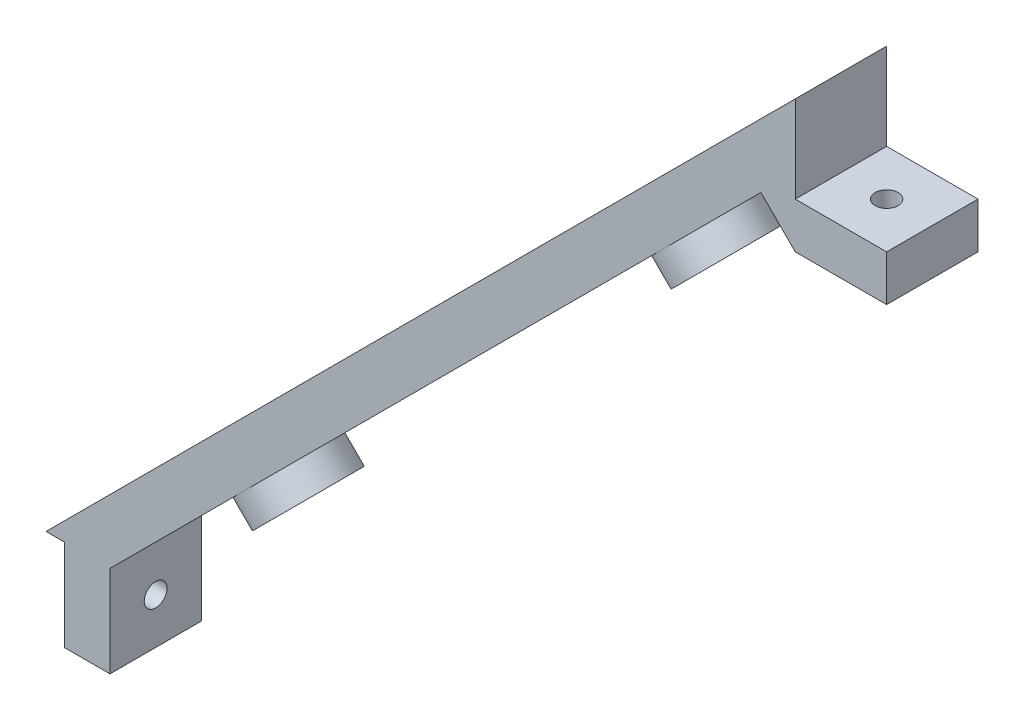
ISO-10303-21;
HEADER;
FILE_DESCRIPTION(('STEP AP214'),'2;1');
FILE_NAME('part.step','',(''),(''),'','','');
FILE_SCHEMA(('AUTOMOTIVE_DESIGN { 1 0 10303 214 1 1 1 1 }'));
ENDSEC;
DATA;
#1=APPLICATION_CONTEXT('core data for automotive mechanical design processes');
#2=APPLICATION_PROTOCOL_DEFINITION('international standard','automotive_design',2000,#1);
#3=PRODUCT_CONTEXT('',#1,'mechanical');
#4=PRODUCT('Part','Part','',(#3));
#5=PRODUCT_RELATED_PRODUCT_CATEGORY('part','',(#4));
#6=PRODUCT_DEFINITION_FORMATION('','',#4);
#7=PRODUCT_DEFINITION_CONTEXT('part definition',#1,'design');
#8=PRODUCT_DEFINITION('design','',#6,#7);
#9=PRODUCT_DEFINITION_SHAPE('','',#8);
#10=(LENGTH_UNIT() NAMED_UNIT(*) SI_UNIT(.MILLI.,.METRE.));
#11=(NAMED_UNIT(*) PLANE_ANGLE_UNIT() SI_UNIT($,.RADIAN.));
#12=(NAMED_UNIT(*) SI_UNIT($,.STERADIAN.) SOLID_ANGLE_UNIT());
#13=UNCERTAINTY_MEASURE_WITH_UNIT(LENGTH_MEASURE(1.E-05),#10,'distance_accuracy_value','');
#14=(GEOMETRIC_REPRESENTATION_CONTEXT(3) GLOBAL_UNCERTAINTY_ASSIGNED_CONTEXT((#13)) GLOBAL_UNIT_ASSIGNED_CONTEXT((#10,
#11,#12)) REPRESENTATION_CONTEXT('',''));
#15=CARTESIAN_POINT('',(0.,0.,0.));
#16=DIRECTION('',(0.,0.,1.));
#17=DIRECTION('',(1.,0.,0.));
#18=AXIS2_PLACEMENT_3D('',#15,#16,#17);
#19=CARTESIAN_POINT('',(-34.,-41.0000000000001,5.));
#20=DIRECTION('',(-0.707106781186549,0.707106781186546,0.));
#21=DIRECTION('',(-0.707106781186546,-0.707106781186549,0.));
#22=AXIS2_PLACEMENT_3D('',#19,#20,#21);
#23=PLANE('',#22);
#24=CARTESIAN_POINT('',(31.7842712474618,24.784271247462,0.));
#25=DIRECTION('',(-0.707106781186549,0.707106781186546,0.));
#26=DIRECTION('',(-0.707106781186546,-0.707106781186549,0.));
#27=AXIS2_PLACEMENT_3D('',#24,#25,#26);
#28=CIRCLE('',#27,1.25);
#29=CARTESIAN_POINT('',(30.9003877709787,23.9003877709788,0.));
#30=VERTEX_POINT('',#29);
#31=EDGE_CURVE('E212',#30,#30,#28,.T.);
#32=ORIENTED_EDGE('',*,*,#31,.T.);
#33=EDGE_LOOP('',(#32));
#34=FACE_BOUND('',#33,.T.);
#35=DIRECTION('',(0.707106781186546,0.707106781186549,0.));
#36=VECTOR('',#35,1.);
#37=CARTESIAN_POINT('',(-34.,-41.0000000000001,5.));
#38=LINE('',#37,#36);
#39=CARTESIAN_POINT('',(26.4102597104441,19.4102597104442,5.));
#40=VERTEX_POINT('',#39);
#41=CARTESIAN_POINT('',(37.25,30.2500000000001,5.));
#42=VERTEX_POINT('',#41);
#43=EDGE_CURVE('E142',#40,#42,#38,.T.);
#44=ORIENTED_EDGE('',*,*,#43,.F.);
#45=CARTESIAN_POINT('',(26.4102597104441,19.4102597104442,0.));
#46=DIRECTION('',(-0.707106781186549,0.707106781186546,0.));
#47=DIRECTION('',(-0.707106781186546,-0.707106781186549,0.));
#48=AXIS2_PLACEMENT_3D('',#45,#46,#47);
#49=CIRCLE('',#48,5.);
#50=CARTESIAN_POINT('',(26.4102597104441,19.4102597104442,-5.));
#51=VERTEX_POINT('',#50);
#52=EDGE_CURVE('E51',#40,#51,#49,.T.);
#53=ORIENTED_EDGE('',*,*,#52,.T.);
#54=DIRECTION('',(0.707106781186546,0.707106781186549,0.));
#55=VECTOR('',#54,1.);
#56=CARTESIAN_POINT('',(-34.,-41.0000000000001,-5.));
#57=LINE('',#56,#55);
#58=CARTESIAN_POINT('',(37.25,30.2500000000001,-5.));
#59=VERTEX_POINT('',#58);
#60=EDGE_CURVE('E140',#51,#59,#57,.T.);
#61=ORIENTED_EDGE('',*,*,#60,.T.);
#62=DIRECTION('',(0.,0.,-1.));
#63=VECTOR('',#62,1.);
#64=CARTESIAN_POINT('',(37.25,30.2500000000001,5.));
#65=LINE('',#64,#63);
#66=EDGE_CURVE('E193',#42,#59,#65,.T.);
#67=ORIENTED_EDGE('',*,*,#66,.F.);
#68=EDGE_LOOP('',(#44,#53,#61,#67));
#69=FACE_BOUND('',#68,.T.);
#70=ADVANCED_FACE('F35',(#34,#69),#23,.F.);
#71=CARTESIAN_POINT('',(-10.6421356237309,-17.6421356237309,0.));
#72=DIRECTION('',(-0.707106781186549,0.707106781186546,0.));
#73=DIRECTION('',(-0.707106781186546,-0.707106781186549,0.));
#74=AXIS2_PLACEMENT_3D('',#71,#72,#73);
#75=CIRCLE('',#74,1.25);
#76=CARTESIAN_POINT('',(-11.5260191002141,-18.5260191002141,0.));
#77=VERTEX_POINT('',#76);
#78=EDGE_CURVE('E334',#77,#77,#75,.T.);
#79=ORIENTED_EDGE('',*,*,#78,.T.);
#80=EDGE_LOOP('',(#79));
#81=FACE_BOUND('',#80,.T.);
#82=CARTESIAN_POINT('',(3.5,-3.49999999999998,0.));
#83=DIRECTION('',(-0.707106781186549,0.707106781186546,0.));
#84=DIRECTION('',(-0.707106781186546,-0.707106781186549,0.));
#85=AXIS2_PLACEMENT_3D('',#82,#83,#84);
#86=CIRCLE('',#85,1.25);
#87=CARTESIAN_POINT('',(2.61611652351681,-4.38388347648317,0.));
#88=VERTEX_POINT('',#87);
#89=EDGE_CURVE('E220',#88,#88,#86,.T.);
#90=ORIENTED_EDGE('',*,*,#89,.T.);
#91=EDGE_LOOP('',(#90));
#92=FACE_BOUND('',#91,.T.);
#93=CARTESIAN_POINT('',(17.6421356237309,10.642135623731,0.));
#94=DIRECTION('',(-0.707106781186549,0.707106781186546,0.));
#95=DIRECTION('',(-0.707106781186546,-0.707106781186549,0.));
#96=AXIS2_PLACEMENT_3D('',#93,#94,#95);
#97=CIRCLE('',#96,1.25);
#98=CARTESIAN_POINT('',(16.7582521472477,9.75825214724781,0.));
#99=VERTEX_POINT('',#98);
#100=EDGE_CURVE('E216',#99,#99,#97,.T.);
#101=ORIENTED_EDGE('',*,*,#100,.T.);
#102=EDGE_LOOP('',(#101));
#103=FACE_BOUND('',#102,.T.);
#104=CARTESIAN_POINT('',(-19.4102597104441,-26.4102597104442,-5.));
#105=VERTEX_POINT('',#104);
#106=EDGE_CURVE('E151',#105,#51,#57,.T.);
#107=ORIENTED_EDGE('',*,*,#106,.T.);
#108=EDGE_CURVE('E129',#51,#40,#49,.T.);
#109=ORIENTED_EDGE('',*,*,#108,.T.);
#110=CARTESIAN_POINT('',(-19.4102597104441,-26.4102597104442,5.));
#111=VERTEX_POINT('',#110);
#112=EDGE_CURVE('E273',#111,#40,#38,.T.);
#113=ORIENTED_EDGE('',*,*,#112,.F.);
#114=CARTESIAN_POINT('',(-19.4102597104441,-26.4102597104442,0.));
#115=DIRECTION('',(-0.707106781186549,0.707106781186546,0.));
#116=DIRECTION('',(-0.707106781186546,-0.707106781186549,0.));
#117=AXIS2_PLACEMENT_3D('',#114,#115,#116);
#118=CIRCLE('',#117,5.);
#119=EDGE_CURVE('E58',#111,#105,#118,.T.);
#120=ORIENTED_EDGE('',*,*,#119,.T.);
#121=EDGE_LOOP('',(#107,#109,#113,#120));
#122=FACE_BOUND('',#121,.T.);
#123=ADVANCED_FACE('F158',(#81,#92,#103,#122),#23,.F.);
#124=CARTESIAN_POINT('',(-41.,-41.0000000000001,5.));
#125=DIRECTION('',(0.,1.,0.));
#126=DIRECTION('',(0.,0.,1.));
#127=AXIS2_PLACEMENT_3D('',#124,#125,#126);
#128=PLANE('',#127);
#129=DIRECTION('',(1.,0.,0.));
#130=VECTOR('',#129,1.);
#131=CARTESIAN_POINT('',(-41.,-41.0000000000001,-5.));
#132=LINE('',#131,#130);
#133=CARTESIAN_POINT('',(-41.,-41.0000000000001,-5.));
#134=VERTEX_POINT('',#133);
#135=CARTESIAN_POINT('',(-39.,-41.0000000000001,-5.));
#136=VERTEX_POINT('',#135);
#137=EDGE_CURVE('E260',#134,#136,#132,.T.);
#138=ORIENTED_EDGE('',*,*,#137,.T.);
#139=DIRECTION('',(0.,0.,-1.));
#140=VECTOR('',#139,1.);
#141=CARTESIAN_POINT('',(-39.,-41.0000000000001,5.));
#142=LINE('',#141,#140);
#143=CARTESIAN_POINT('',(-39.,-41.0000000000001,5.));
#144=VERTEX_POINT('',#143);
#145=EDGE_CURVE('E11',#144,#136,#142,.T.);
#146=ORIENTED_EDGE('',*,*,#145,.F.);
#147=DIRECTION('',(1.,0.,0.));
#148=VECTOR('',#147,1.);
#149=CARTESIAN_POINT('',(-41.,-41.0000000000001,5.));
#150=LINE('',#149,#148);
#151=CARTESIAN_POINT('',(-41.,-41.0000000000001,5.));
#152=VERTEX_POINT('',#151);
#153=EDGE_CURVE('E173',#152,#144,#150,.T.);
#154=ORIENTED_EDGE('',*,*,#153,.F.);
#155=DIRECTION('',(0.,0.,-1.));
#156=VECTOR('',#155,1.);
#157=CARTESIAN_POINT('',(-41.,-41.0000000000001,5.));
#158=LINE('',#157,#156);
#159=EDGE_CURVE('E174',#152,#134,#158,.T.);
#160=ORIENTED_EDGE('',*,*,#159,.T.);
#161=EDGE_LOOP('',(#138,#146,#154,#160));
#162=FACE_BOUND('',#161,.T.);
#163=ADVANCED_FACE('F37',(#162),#128,.F.);
#164=CARTESIAN_POINT('',(-39.,-41.0000000000001,5.));
#165=DIRECTION('',(1.,0.,0.));
#166=DIRECTION('',(0.,0.,-1.));
#167=AXIS2_PLACEMENT_3D('',#164,#165,#166);
#168=PLANE('',#167);
#169=CARTESIAN_POINT('',(-39.,-46.0000000000003,0.));
#170=DIRECTION('',(1.,0.,0.));
#171=DIRECTION('',(0.,0.,-1.));
#172=AXIS2_PLACEMENT_3D('',#169,#170,#171);
#173=CIRCLE('',#172,1.25);
#174=CARTESIAN_POINT('',(-39.,-46.0000000000003,-1.25));
#175=VERTEX_POINT('',#174);
#176=EDGE_CURVE('E206',#175,#175,#173,.T.);
#177=ORIENTED_EDGE('',*,*,#176,.T.);
#178=EDGE_LOOP('',(#177));
#179=FACE_BOUND('',#178,.T.);
#180=DIRECTION('',(0.,-1.,0.));
#181=VECTOR('',#180,1.);
#182=CARTESIAN_POINT('',(-39.,-41.0000000000001,-5.));
#183=LINE('',#182,#181);
#184=CARTESIAN_POINT('',(-39.,-51.0000000000001,-5.));
#185=VERTEX_POINT('',#184);
#186=EDGE_CURVE('E286',#136,#185,#183,.T.);
#187=ORIENTED_EDGE('',*,*,#186,.T.);
#188=DIRECTION('',(0.,0.,-1.));
#189=VECTOR('',#188,1.);
#190=CARTESIAN_POINT('',(-39.,-51.0000000000001,5.));
#191=LINE('',#190,#189);
#192=CARTESIAN_POINT('',(-39.,-51.0000000000001,5.));
#193=VERTEX_POINT('',#192);
#194=EDGE_CURVE('E44',#193,#185,#191,.T.);
#195=ORIENTED_EDGE('',*,*,#194,.F.);
#196=DIRECTION('',(0.,-1.,0.));
#197=VECTOR('',#196,1.);
#198=CARTESIAN_POINT('',(-39.,-41.0000000000001,5.));
#199=LINE('',#198,#197);
#200=EDGE_CURVE('E263',#144,#193,#199,.T.);
#201=ORIENTED_EDGE('',*,*,#200,.F.);
#202=ORIENTED_EDGE('',*,*,#145,.T.);
#203=EDGE_LOOP('',(#187,#195,#201,#202));
#204=FACE_BOUND('',#203,.T.);
#205=ADVANCED_FACE('F305',(#179,#204),#168,.F.);
#206=CARTESIAN_POINT('',(-39.,-51.0000000000001,5.));
#207=DIRECTION('',(0.,1.,0.));
#208=DIRECTION('',(-1.,0.,0.));
#209=AXIS2_PLACEMENT_3D('',#206,#207,#208);
#210=PLANE('',#209);
#211=DIRECTION('',(1.,0.,0.));
#212=VECTOR('',#211,1.);
#213=CARTESIAN_POINT('',(-39.,-51.0000000000001,-5.));
#214=LINE('',#213,#212);
#215=CARTESIAN_POINT('',(-34.,-51.0000000000001,-5.));
#216=VERTEX_POINT('',#215);
#217=EDGE_CURVE('E287',#185,#216,#214,.T.);
#218=ORIENTED_EDGE('',*,*,#217,.T.);
#219=DIRECTION('',(0.,0.,-1.));
#220=VECTOR('',#219,1.);
#221=CARTESIAN_POINT('',(-34.,-51.0000000000001,5.));
#222=LINE('',#221,#220);
#223=CARTESIAN_POINT('',(-34.,-51.0000000000001,5.));
#224=VERTEX_POINT('',#223);
#225=EDGE_CURVE('E198',#224,#216,#222,.T.);
#226=ORIENTED_EDGE('',*,*,#225,.F.);
#227=DIRECTION('',(1.,0.,0.));
#228=VECTOR('',#227,1.);
#229=CARTESIAN_POINT('',(-39.,-51.0000000000001,5.));
#230=LINE('',#229,#228);
#231=EDGE_CURVE('E265',#193,#224,#230,.T.);
#232=ORIENTED_EDGE('',*,*,#231,.F.);
#233=ORIENTED_EDGE('',*,*,#194,.T.);
#234=EDGE_LOOP('',(#218,#226,#232,#233));
#235=FACE_BOUND('',#234,.T.);
#236=ADVANCED_FACE('F303',(#235),#210,.F.);
#237=CARTESIAN_POINT('',(-34.,-51.0000000000001,5.));
#238=DIRECTION('',(-1.,0.,0.));
#239=DIRECTION('',(0.,0.,1.));
#240=AXIS2_PLACEMENT_3D('',#237,#238,#239);
#241=PLANE('',#240);
#242=CARTESIAN_POINT('',(-34.,-46.0000000000003,0.));
#243=DIRECTION('',(-1.,0.,0.));
#244=DIRECTION('',(0.,0.,1.));
#245=AXIS2_PLACEMENT_3D('',#242,#243,#244);
#246=CIRCLE('',#245,1.25);
#247=CARTESIAN_POINT('',(-34.,-46.0000000000003,1.25));
#248=VERTEX_POINT('',#247);
#249=EDGE_CURVE('E203',#248,#248,#246,.T.);
#250=ORIENTED_EDGE('',*,*,#249,.T.);
#251=EDGE_LOOP('',(#250));
#252=FACE_BOUND('',#251,.T.);
#253=DIRECTION('',(0.,1.,0.));
#254=VECTOR('',#253,1.);
#255=CARTESIAN_POINT('',(-34.,-51.0000000000001,-5.));
#256=LINE('',#255,#254);
#257=CARTESIAN_POINT('',(-34.,-41.0000000000001,-5.));
#258=VERTEX_POINT('',#257);
#259=EDGE_CURVE('E155',#216,#258,#256,.T.);
#260=ORIENTED_EDGE('',*,*,#259,.T.);
#261=DIRECTION('',(0.,0.,-1.));
#262=VECTOR('',#261,1.);
#263=CARTESIAN_POINT('',(-34.,-41.0000000000001,5.));
#264=LINE('',#263,#262);
#265=CARTESIAN_POINT('',(-34.,-41.0000000000001,5.));
#266=VERTEX_POINT('',#265);
#267=EDGE_CURVE('E195',#266,#258,#264,.T.);
#268=ORIENTED_EDGE('',*,*,#267,.F.);
#269=DIRECTION('',(0.,1.,0.));
#270=VECTOR('',#269,1.);
#271=CARTESIAN_POINT('',(-34.,-51.0000000000001,5.));
#272=LINE('',#271,#270);
#273=EDGE_CURVE('E267',#224,#266,#272,.T.);
#274=ORIENTED_EDGE('',*,*,#273,.F.);
#275=ORIENTED_EDGE('',*,*,#225,.T.);
#276=EDGE_LOOP('',(#260,#268,#274,#275));
#277=FACE_BOUND('',#276,.T.);
#278=ADVANCED_FACE('F294',(#252,#277),#241,.F.);
#279=CARTESIAN_POINT('',(-24.7842712474619,-31.7842712474619,0.));
#280=DIRECTION('',(-0.707106781186549,0.707106781186546,0.));
#281=DIRECTION('',(-0.707106781186546,-0.707106781186549,0.));
#282=AXIS2_PLACEMENT_3D('',#279,#280,#281);
#283=CIRCLE('',#282,1.25);
#284=CARTESIAN_POINT('',(-25.668154723945,-32.6681547239451,0.));
#285=VERTEX_POINT('',#284);
#286=EDGE_CURVE('E332',#285,#285,#283,.T.);
#287=ORIENTED_EDGE('',*,*,#286,.T.);
#288=EDGE_LOOP('',(#287));
#289=FACE_BOUND('',#288,.T.);
#290=EDGE_CURVE('E157',#258,#105,#57,.T.);
#291=ORIENTED_EDGE('',*,*,#290,.T.);
#292=EDGE_CURVE('E247',#105,#111,#118,.T.);
#293=ORIENTED_EDGE('',*,*,#292,.T.);
#294=EDGE_CURVE('E269',#266,#111,#38,.T.);
#295=ORIENTED_EDGE('',*,*,#294,.F.);
#296=ORIENTED_EDGE('',*,*,#267,.T.);
#297=EDGE_LOOP('',(#291,#293,#295,#296));
#298=FACE_BOUND('',#297,.T.);
#299=ADVANCED_FACE('F298',(#289,#298),#23,.F.);
#300=CARTESIAN_POINT('',(41.,26.5000000000002,5.));
#301=DIRECTION('',(0.707106781186546,0.707106781186549,0.));
#302=DIRECTION('',(-0.707106781186549,0.707106781186546,0.));
#303=AXIS2_PLACEMENT_3D('',#300,#301,#302);
#304=PLANE('',#303);
#305=DIRECTION('',(0.707106781186549,-0.707106781186546,0.));
#306=VECTOR('',#305,1.);
#307=CARTESIAN_POINT('',(41.,26.5000000000002,-5.));
#308=LINE('',#307,#306);
#309=CARTESIAN_POINT('',(41.,26.5000000000002,-5.));
#310=VERTEX_POINT('',#309);
#311=EDGE_CURVE('E154',#59,#310,#308,.T.);
#312=ORIENTED_EDGE('',*,*,#311,.T.);
#313=DIRECTION('',(0.,0.,-1.));
#314=VECTOR('',#313,1.);
#315=CARTESIAN_POINT('',(41.,26.5000000000002,5.));
#316=LINE('',#315,#314);
#317=CARTESIAN_POINT('',(41.,26.5000000000002,5.));
#318=VERTEX_POINT('',#317);
#319=EDGE_CURVE('E190',#318,#310,#316,.T.);
#320=ORIENTED_EDGE('',*,*,#319,.F.);
#321=DIRECTION('',(0.707106781186549,-0.707106781186546,0.));
#322=VECTOR('',#321,1.);
#323=CARTESIAN_POINT('',(41.,26.5000000000002,5.));
#324=LINE('',#323,#322);
#325=EDGE_CURVE('E272',#42,#318,#324,.T.);
#326=ORIENTED_EDGE('',*,*,#325,.F.);
#327=ORIENTED_EDGE('',*,*,#66,.T.);
#328=EDGE_LOOP('',(#312,#320,#326,#327));
#329=FACE_BOUND('',#328,.T.);
#330=ADVANCED_FACE('F323',(#329),#304,.F.);
#331=CARTESIAN_POINT('',(41.,26.5000000000002,5.));
#332=DIRECTION('',(0.,1.,0.));
#333=DIRECTION('',(0.,0.,1.));
#334=AXIS2_PLACEMENT_3D('',#331,#332,#333);
#335=PLANE('',#334);
#336=CARTESIAN_POINT('',(46.,26.5000000000002,0.));
#337=DIRECTION('',(0.,1.,0.));
#338=DIRECTION('',(0.,0.,1.));
#339=AXIS2_PLACEMENT_3D('',#336,#337,#338);
#340=CIRCLE('',#339,1.25);
#341=CARTESIAN_POINT('',(46.,26.5000000000002,1.25));
#342=VERTEX_POINT('',#341);
#343=EDGE_CURVE('E207',#342,#342,#340,.F.);
#344=ORIENTED_EDGE('',*,*,#343,.F.);
#345=EDGE_LOOP('',(#344));
#346=FACE_BOUND('',#345,.T.);
#347=DIRECTION('',(1.,0.,0.));
#348=VECTOR('',#347,1.);
#349=CARTESIAN_POINT('',(41.,26.5000000000002,-5.));
#350=LINE('',#349,#348);
#351=CARTESIAN_POINT('',(51.,26.5000000000002,-5.));
#352=VERTEX_POINT('',#351);
#353=EDGE_CURVE('E163',#310,#352,#350,.T.);
#354=ORIENTED_EDGE('',*,*,#353,.T.);
#355=DIRECTION('',(0.,0.,-1.));
#356=VECTOR('',#355,1.);
#357=CARTESIAN_POINT('',(51.,26.5000000000002,5.));
#358=LINE('',#357,#356);
#359=CARTESIAN_POINT('',(51.,26.5000000000002,5.));
#360=VERTEX_POINT('',#359);
#361=EDGE_CURVE('E187',#360,#352,#358,.T.);
#362=ORIENTED_EDGE('',*,*,#361,.F.);
#363=DIRECTION('',(1.,0.,0.));
#364=VECTOR('',#363,1.);
#365=CARTESIAN_POINT('',(41.,26.5000000000002,5.));
#366=LINE('',#365,#364);
#367=EDGE_CURVE('E275',#318,#360,#366,.T.);
#368=ORIENTED_EDGE('',*,*,#367,.F.);
#369=ORIENTED_EDGE('',*,*,#319,.T.);
#370=EDGE_LOOP('',(#354,#362,#368,#369));
#371=FACE_BOUND('',#370,.T.);
#372=ADVANCED_FACE('F328',(#346,#371),#335,.F.);
#373=CARTESIAN_POINT('',(51.,31.5000000000002,5.));
#374=DIRECTION('',(-1.,0.,0.));
#375=DIRECTION('',(0.,-1.,0.));
#376=AXIS2_PLACEMENT_3D('',#373,#374,#375);
#377=PLANE('',#376);
#378=DIRECTION('',(0.,1.,0.));
#379=VECTOR('',#378,1.);
#380=CARTESIAN_POINT('',(51.,31.5000000000002,-5.));
#381=LINE('',#380,#379);
#382=CARTESIAN_POINT('',(51.,31.5000000000002,-5.));
#383=VERTEX_POINT('',#382);
#384=EDGE_CURVE('E165',#352,#383,#381,.T.);
#385=ORIENTED_EDGE('',*,*,#384,.T.);
#386=DIRECTION('',(0.,0.,-1.));
#387=VECTOR('',#386,1.);
#388=CARTESIAN_POINT('',(51.,31.5000000000002,5.));
#389=LINE('',#388,#387);
#390=CARTESIAN_POINT('',(51.,31.5000000000002,5.));
#391=VERTEX_POINT('',#390);
#392=EDGE_CURVE('E184',#391,#383,#389,.T.);
#393=ORIENTED_EDGE('',*,*,#392,.F.);
#394=DIRECTION('',(0.,1.,0.));
#395=VECTOR('',#394,1.);
#396=CARTESIAN_POINT('',(51.,31.5000000000002,5.));
#397=LINE('',#396,#395);
#398=EDGE_CURVE('E277',#360,#391,#397,.T.);
#399=ORIENTED_EDGE('',*,*,#398,.F.);
#400=ORIENTED_EDGE('',*,*,#361,.T.);
#401=EDGE_LOOP('',(#385,#393,#399,#400));
#402=FACE_BOUND('',#401,.T.);
#403=ADVANCED_FACE('F384',(#402),#377,.F.);
#404=CARTESIAN_POINT('',(51.,31.5000000000002,5.));
#405=DIRECTION('',(0.,-1.,0.));
#406=DIRECTION('',(0.,0.,-1.));
#407=AXIS2_PLACEMENT_3D('',#404,#405,#406);
#408=PLANE('',#407);
#409=CARTESIAN_POINT('',(46.,31.5000000000002,0.));
#410=DIRECTION('',(0.,-1.,0.));
#411=DIRECTION('',(0.,0.,-1.));
#412=AXIS2_PLACEMENT_3D('',#409,#410,#411);
#413=CIRCLE('',#412,1.25);
#414=CARTESIAN_POINT('',(46.,31.5000000000002,-1.24999999999999));
#415=VERTEX_POINT('',#414);
#416=EDGE_CURVE('E252',#415,#415,#413,.T.);
#417=ORIENTED_EDGE('',*,*,#416,.T.);
#418=EDGE_LOOP('',(#417));
#419=FACE_BOUND('',#418,.T.);
#420=DIRECTION('',(-1.,0.,0.));
#421=VECTOR('',#420,1.);
#422=CARTESIAN_POINT('',(51.,31.5000000000002,-5.));
#423=LINE('',#422,#421);
#424=CARTESIAN_POINT('',(41.,31.5000000000002,-5.));
#425=VERTEX_POINT('',#424);
#426=EDGE_CURVE('E167',#383,#425,#423,.T.);
#427=ORIENTED_EDGE('',*,*,#426,.T.);
#428=DIRECTION('',(0.,0.,-1.));
#429=VECTOR('',#428,1.);
#430=CARTESIAN_POINT('',(41.,31.5000000000002,5.));
#431=LINE('',#430,#429);
#432=CARTESIAN_POINT('',(41.,31.5000000000002,5.));
#433=VERTEX_POINT('',#432);
#434=EDGE_CURVE('E181',#433,#425,#431,.T.);
#435=ORIENTED_EDGE('',*,*,#434,.F.);
#436=DIRECTION('',(-1.,0.,0.));
#437=VECTOR('',#436,1.);
#438=CARTESIAN_POINT('',(51.,31.5000000000002,5.));
#439=LINE('',#438,#437);
#440=EDGE_CURVE('E279',#391,#433,#439,.T.);
#441=ORIENTED_EDGE('',*,*,#440,.F.);
#442=ORIENTED_EDGE('',*,*,#392,.T.);
#443=EDGE_LOOP('',(#427,#435,#441,#442));
#444=FACE_BOUND('',#443,.T.);
#445=ADVANCED_FACE('F380',(#419,#444),#408,.F.);
#446=CARTESIAN_POINT('',(41.,41.0000000000002,5.));
#447=DIRECTION('',(-1.,0.,0.));
#448=DIRECTION('',(0.,-1.,0.));
#449=AXIS2_PLACEMENT_3D('',#446,#447,#448);
#450=PLANE('',#449);
#451=DIRECTION('',(0.,1.,0.));
#452=VECTOR('',#451,1.);
#453=CARTESIAN_POINT('',(41.,41.0000000000002,-5.));
#454=LINE('',#453,#452);
#455=CARTESIAN_POINT('',(41.,41.0000000000002,-5.));
#456=VERTEX_POINT('',#455);
#457=EDGE_CURVE('E169',#425,#456,#454,.T.);
#458=ORIENTED_EDGE('',*,*,#457,.T.);
#459=DIRECTION('',(0.,0.,-1.));
#460=VECTOR('',#459,1.);
#461=CARTESIAN_POINT('',(41.,41.0000000000002,5.));
#462=LINE('',#461,#460);
#463=CARTESIAN_POINT('',(41.,41.0000000000002,5.));
#464=VERTEX_POINT('',#463);
#465=EDGE_CURVE('E177',#464,#456,#462,.T.);
#466=ORIENTED_EDGE('',*,*,#465,.F.);
#467=DIRECTION('',(0.,1.,0.));
#468=VECTOR('',#467,1.);
#469=CARTESIAN_POINT('',(41.,41.0000000000002,5.));
#470=LINE('',#469,#468);
#471=EDGE_CURVE('E281',#433,#464,#470,.T.);
#472=ORIENTED_EDGE('',*,*,#471,.F.);
#473=ORIENTED_EDGE('',*,*,#434,.T.);
#474=EDGE_LOOP('',(#458,#466,#472,#473));
#475=FACE_BOUND('',#474,.T.);
#476=ADVANCED_FACE('F353',(#475),#450,.F.);
#477=CARTESIAN_POINT('',(-41.,-41.0000000000001,5.));
#478=DIRECTION('',(0.707106781186549,-0.707106781186546,0.));
#479=DIRECTION('',(0.707106781186546,0.707106781186549,0.));
#480=AXIS2_PLACEMENT_3D('',#477,#478,#479);
#481=PLANE('',#480);
#482=CARTESIAN_POINT('',(-14.1421356237309,-14.142135623731,0.));
#483=DIRECTION('',(0.707106781186549,-0.707106781186546,0.));
#484=DIRECTION('',(0.707106781186546,0.707106781186549,0.));
#485=AXIS2_PLACEMENT_3D('',#482,#483,#484);
#486=CIRCLE('',#485,1.25);
#487=CARTESIAN_POINT('',(-13.2582521472477,-13.2582521472478,0.));
#488=VERTEX_POINT('',#487);
#489=EDGE_CURVE('E39',#488,#488,#486,.F.);
#490=ORIENTED_EDGE('',*,*,#489,.F.);
#491=EDGE_LOOP('',(#490));
#492=FACE_BOUND('',#491,.T.);
#493=CARTESIAN_POINT('',(-28.2842712474619,-28.2842712474619,0.));
#494=DIRECTION('',(0.707106781186549,-0.707106781186546,0.));
#495=DIRECTION('',(0.707106781186546,0.707106781186549,0.));
#496=AXIS2_PLACEMENT_3D('',#493,#494,#495);
#497=CIRCLE('',#496,1.25);
#498=CARTESIAN_POINT('',(-27.4003877709787,-27.4003877709788,0.));
#499=VERTEX_POINT('',#498);
#500=EDGE_CURVE('E219',#499,#499,#497,.F.);
#501=ORIENTED_EDGE('',*,*,#500,.F.);
#502=EDGE_LOOP('',(#501));
#503=FACE_BOUND('',#502,.T.);
#504=CARTESIAN_POINT('',(0.,0.,0.));
#505=DIRECTION('',(0.707106781186549,-0.707106781186546,0.));
#506=DIRECTION('',(0.707106781186546,0.707106781186549,0.));
#507=AXIS2_PLACEMENT_3D('',#504,#505,#506);
#508=CIRCLE('',#507,1.25);
#509=CARTESIAN_POINT('',(0.88388347648317,0.883883476483208,0.));
#510=VERTEX_POINT('',#509);
#511=EDGE_CURVE('E217',#510,#510,#508,.F.);
#512=ORIENTED_EDGE('',*,*,#511,.F.);
#513=EDGE_LOOP('',(#512));
#514=FACE_BOUND('',#513,.T.);
#515=CARTESIAN_POINT('',(14.1421356237309,14.142135623731,0.));
#516=DIRECTION('',(0.707106781186549,-0.707106781186546,0.));
#517=DIRECTION('',(0.707106781186546,0.707106781186549,0.));
#518=AXIS2_PLACEMENT_3D('',#515,#516,#517);
#519=CIRCLE('',#518,1.25);
#520=CARTESIAN_POINT('',(15.0260191002141,15.0260191002142,0.));
#521=VERTEX_POINT('',#520);
#522=EDGE_CURVE('E213',#521,#521,#519,.F.);
#523=ORIENTED_EDGE('',*,*,#522,.F.);
#524=EDGE_LOOP('',(#523));
#525=FACE_BOUND('',#524,.T.);
#526=CARTESIAN_POINT('',(28.2842712474618,28.284271247462,0.));
#527=DIRECTION('',(0.707106781186549,-0.707106781186546,0.));
#528=DIRECTION('',(0.707106781186546,0.707106781186549,0.));
#529=AXIS2_PLACEMENT_3D('',#526,#527,#528);
#530=CIRCLE('',#529,1.25);
#531=CARTESIAN_POINT('',(29.168154723945,29.1681547239452,0.));
#532=VERTEX_POINT('',#531);
#533=EDGE_CURVE('E208',#532,#532,#530,.F.);
#534=ORIENTED_EDGE('',*,*,#533,.F.);
#535=EDGE_LOOP('',(#534));
#536=FACE_BOUND('',#535,.T.);
#537=CARTESIAN_POINT('',(-22.9102597104441,-22.9102597104442,0.));
#538=DIRECTION('',(0.707106781186549,-0.707106781186546,0.));
#539=DIRECTION('',(0.707106781186546,0.707106781186549,0.));
#540=AXIS2_PLACEMENT_3D('',#537,#538,#539);
#541=CIRCLE('',#540,1.25);
#542=CARTESIAN_POINT('',(-22.0263762339609,-22.026376233961,0.));
#543=VERTEX_POINT('',#542);
#544=EDGE_CURVE('E238',#543,#543,#541,.T.);
#545=ORIENTED_EDGE('',*,*,#544,.T.);
#546=EDGE_LOOP('',(#545));
#547=FACE_BOUND('',#546,.T.);
#548=CARTESIAN_POINT('',(22.9102597104441,22.9102597104442,0.));
#549=DIRECTION('',(0.707106781186549,-0.707106781186546,0.));
#550=DIRECTION('',(0.707106781186546,0.707106781186549,0.));
#551=AXIS2_PLACEMENT_3D('',#548,#549,#550);
#552=CIRCLE('',#551,1.25);
#553=CARTESIAN_POINT('',(23.7941431869273,23.7941431869274,0.));
#554=VERTEX_POINT('',#553);
#555=EDGE_CURVE('E135',#554,#554,#552,.T.);
#556=ORIENTED_EDGE('',*,*,#555,.T.);
#557=EDGE_LOOP('',(#556));
#558=FACE_BOUND('',#557,.T.);
#559=DIRECTION('',(-0.707106781186546,-0.707106781186549,0.));
#560=VECTOR('',#559,1.);
#561=CARTESIAN_POINT('',(-41.,-41.0000000000001,-5.));
#562=LINE('',#561,#560);
#563=EDGE_CURVE('E171',#456,#134,#562,.T.);
#564=ORIENTED_EDGE('',*,*,#563,.T.);
#565=ORIENTED_EDGE('',*,*,#159,.F.);
#566=DIRECTION('',(-0.707106781186546,-0.707106781186549,0.));
#567=VECTOR('',#566,1.);
#568=CARTESIAN_POINT('',(-41.,-41.0000000000001,5.));
#569=LINE('',#568,#567);
#570=EDGE_CURVE('E178',#464,#152,#569,.T.);
#571=ORIENTED_EDGE('',*,*,#570,.F.);
#572=ORIENTED_EDGE('',*,*,#465,.T.);
#573=EDGE_LOOP('',(#564,#565,#571,#572));
#574=FACE_BOUND('',#573,.T.);
#575=ADVANCED_FACE('F350',(#492,#503,#514,#525,#536,#547,#558,#574),#481,.F.);
#576=CARTESIAN_POINT('',(0.,0.,5.));
#577=DIRECTION('',(0.,0.,-1.));
#578=DIRECTION('',(-1.,0.,0.));
#579=AXIS2_PLACEMENT_3D('',#576,#577,#578);
#580=PLANE('',#579);
#581=ORIENTED_EDGE('',*,*,#153,.T.);
#582=ORIENTED_EDGE('',*,*,#200,.T.);
#583=ORIENTED_EDGE('',*,*,#231,.T.);
#584=ORIENTED_EDGE('',*,*,#273,.T.);
#585=ORIENTED_EDGE('',*,*,#294,.T.);
#586=ORIENTED_EDGE('',*,*,#112,.T.);
#587=ORIENTED_EDGE('',*,*,#43,.T.);
#588=ORIENTED_EDGE('',*,*,#325,.T.);
#589=ORIENTED_EDGE('',*,*,#367,.T.);
#590=ORIENTED_EDGE('',*,*,#398,.T.);
#591=ORIENTED_EDGE('',*,*,#440,.T.);
#592=ORIENTED_EDGE('',*,*,#471,.T.);
#593=ORIENTED_EDGE('',*,*,#570,.T.);
#594=EDGE_LOOP('',(#581,#582,#583,#584,#585,#586,#587,#588,#589,#590,#591,#592,#593));
#595=FACE_BOUND('',#594,.T.);
#596=ADVANCED_FACE('F300',(#595),#580,.F.);
#597=CARTESIAN_POINT('',(0.,0.,-5.));
#598=DIRECTION('',(0.,0.,-1.));
#599=DIRECTION('',(-1.,0.,0.));
#600=AXIS2_PLACEMENT_3D('',#597,#598,#599);
#601=PLANE('',#600);
#602=ORIENTED_EDGE('',*,*,#137,.F.);
#603=ORIENTED_EDGE('',*,*,#563,.F.);
#604=ORIENTED_EDGE('',*,*,#457,.F.);
#605=ORIENTED_EDGE('',*,*,#426,.F.);
#606=ORIENTED_EDGE('',*,*,#384,.F.);
#607=ORIENTED_EDGE('',*,*,#353,.F.);
#608=ORIENTED_EDGE('',*,*,#311,.F.);
#609=ORIENTED_EDGE('',*,*,#60,.F.);
#610=ORIENTED_EDGE('',*,*,#106,.F.);
#611=ORIENTED_EDGE('',*,*,#290,.F.);
#612=ORIENTED_EDGE('',*,*,#259,.F.);
#613=ORIENTED_EDGE('',*,*,#217,.F.);
#614=ORIENTED_EDGE('',*,*,#186,.F.);
#615=EDGE_LOOP('',(#602,#603,#604,#605,#606,#607,#608,#609,#610,#611,#612,#613,#614));
#616=FACE_BOUND('',#615,.T.);
#617=ADVANCED_FACE('F149',(#616),#601,.T.);
#618=CARTESIAN_POINT('',(-41.,-46.0000000000003,0.));
#619=DIRECTION('',(1.,0.,0.));
#620=DIRECTION('',(0.,1.,0.));
#621=AXIS2_PLACEMENT_3D('',#618,#619,#620);
#622=CYLINDRICAL_SURFACE('',#621,1.25);
#623=ORIENTED_EDGE('',*,*,#249,.F.);
#624=EDGE_LOOP('',(#623));
#625=FACE_BOUND('',#624,.T.);
#626=ORIENTED_EDGE('',*,*,#176,.F.);
#627=EDGE_LOOP('',(#626));
#628=FACE_BOUND('',#627,.T.);
#629=ADVANCED_FACE('F406',(#625,#628),#622,.F.);
#630=CARTESIAN_POINT('',(46.,-51.0000000000001,0.));
#631=DIRECTION('',(0.,1.,0.));
#632=DIRECTION('',(0.,0.,1.));
#633=AXIS2_PLACEMENT_3D('',#630,#631,#632);
#634=CYLINDRICAL_SURFACE('',#633,1.25);
#635=ORIENTED_EDGE('',*,*,#416,.F.);
#636=EDGE_LOOP('',(#635));
#637=FACE_BOUND('',#636,.T.);
#638=ORIENTED_EDGE('',*,*,#343,.T.);
#639=EDGE_LOOP('',(#638));
#640=FACE_BOUND('',#639,.T.);
#641=ADVANCED_FACE('F411',(#637,#640),#634,.F.);
#642=CARTESIAN_POINT('',(-17.2889393668845,-28.5315800540038,0.));
#643=DIRECTION('',(-0.707106781186549,0.707106781186546,0.));
#644=DIRECTION('',(-0.707106781186546,-0.707106781186549,0.));
#645=AXIS2_PLACEMENT_3D('',#642,#643,#644);
#646=CYLINDRICAL_SURFACE('',#645,5.);
#647=CARTESIAN_POINT('',(-17.2889393668845,-28.5315800540038,0.));
#648=DIRECTION('',(-0.707106781186549,0.707106781186546,0.));
#649=DIRECTION('',(-0.707106781186546,-0.707106781186549,0.));
#650=AXIS2_PLACEMENT_3D('',#647,#648,#649);
#651=CIRCLE('',#650,5.);
#652=CARTESIAN_POINT('',(-20.8244732728172,-32.0671139599365,0.));
#653=VERTEX_POINT('',#652);
#654=EDGE_CURVE('E249',#653,#653,#651,.T.);
#655=ORIENTED_EDGE('',*,*,#654,.T.);
#656=EDGE_LOOP('',(#655));
#657=FACE_BOUND('',#656,.T.);
#658=ORIENTED_EDGE('',*,*,#119,.F.);
#659=ORIENTED_EDGE('',*,*,#292,.F.);
#660=EDGE_LOOP('',(#658,#659));
#661=FACE_BOUND('',#660,.T.);
#662=ADVANCED_FACE('F415',(#657,#661),#646,.T.);
#663=CARTESIAN_POINT('',(-17.2889393668845,-28.5315800540038,0.));
#664=DIRECTION('',(-0.707106781186549,0.707106781186546,0.));
#665=DIRECTION('',(-0.707106781186546,-0.707106781186549,0.));
#666=AXIS2_PLACEMENT_3D('',#663,#664,#665);
#667=PLANE('',#666);
#668=CARTESIAN_POINT('',(-17.2889393668845,-28.5315800540038,0.));
#669=DIRECTION('',(0.707106781186549,-0.707106781186546,0.));
#670=DIRECTION('',(0.707106781186546,0.707106781186549,0.));
#671=AXIS2_PLACEMENT_3D('',#668,#669,#670);
#672=CIRCLE('',#671,1.25);
#673=CARTESIAN_POINT('',(-16.4050558904013,-27.6476965775206,0.));
#674=VERTEX_POINT('',#673);
#675=EDGE_CURVE('E211',#674,#674,#672,.T.);
#676=ORIENTED_EDGE('',*,*,#675,.F.);
#677=EDGE_LOOP('',(#676));
#678=FACE_BOUND('',#677,.T.);
#679=ORIENTED_EDGE('',*,*,#654,.F.);
#680=EDGE_LOOP('',(#679));
#681=FACE_BOUND('',#680,.T.);
#682=ADVANCED_FACE('F419',(#678,#681),#667,.F.);
#683=CARTESIAN_POINT('',(28.5315800540037,17.2889393668846,0.));
#684=DIRECTION('',(-0.707106781186549,0.707106781186546,0.));
#685=DIRECTION('',(-0.707106781186546,-0.707106781186549,0.));
#686=AXIS2_PLACEMENT_3D('',#683,#684,#685);
#687=CYLINDRICAL_SURFACE('',#686,5.);
#688=CARTESIAN_POINT('',(28.5315800540037,17.2889393668846,0.));
#689=DIRECTION('',(-0.707106781186549,0.707106781186546,0.));
#690=DIRECTION('',(-0.707106781186546,-0.707106781186549,0.));
#691=AXIS2_PLACEMENT_3D('',#688,#689,#690);
#692=CIRCLE('',#691,5.);
#693=CARTESIAN_POINT('',(24.996046148071,13.7534054609518,0.));
#694=VERTEX_POINT('',#693);
#695=EDGE_CURVE('E144',#694,#694,#692,.T.);
#696=ORIENTED_EDGE('',*,*,#695,.T.);
#697=EDGE_LOOP('',(#696));
#698=FACE_BOUND('',#697,.T.);
#699=ORIENTED_EDGE('',*,*,#52,.F.);
#700=ORIENTED_EDGE('',*,*,#108,.F.);
#701=EDGE_LOOP('',(#699,#700));
#702=FACE_BOUND('',#701,.T.);
#703=ADVANCED_FACE('F130',(#698,#702),#687,.T.);
#704=CARTESIAN_POINT('',(28.5315800540037,17.2889393668846,0.));
#705=DIRECTION('',(-0.707106781186549,0.707106781186546,0.));
#706=DIRECTION('',(-0.707106781186546,-0.707106781186549,0.));
#707=AXIS2_PLACEMENT_3D('',#704,#705,#706);
#708=PLANE('',#707);
#709=CARTESIAN_POINT('',(28.5315800540038,17.2889393668846,0.));
#710=DIRECTION('',(0.707106781186549,-0.707106781186546,0.));
#711=DIRECTION('',(0.707106781186546,0.707106781186549,0.));
#712=AXIS2_PLACEMENT_3D('',#709,#710,#711);
#713=CIRCLE('',#712,1.25);
#714=CARTESIAN_POINT('',(29.4154635304869,18.1728228433677,0.));
#715=VERTEX_POINT('',#714);
#716=EDGE_CURVE('E241',#715,#715,#713,.T.);
#717=ORIENTED_EDGE('',*,*,#716,.F.);
#718=EDGE_LOOP('',(#717));
#719=FACE_BOUND('',#718,.T.);
#720=ORIENTED_EDGE('',*,*,#695,.F.);
#721=EDGE_LOOP('',(#720));
#722=FACE_BOUND('',#721,.T.);
#723=ADVANCED_FACE('F426',(#719,#722),#708,.F.);
#724=CARTESIAN_POINT('',(-18.089740289556,63.9102597104442,0.));
#725=DIRECTION('',(0.707106781186549,-0.707106781186546,0.));
#726=DIRECTION('',(0.707106781186546,0.707106781186549,0.));
#727=AXIS2_PLACEMENT_3D('',#724,#725,#726);
#728=CYLINDRICAL_SURFACE('',#727,1.25);
#729=ORIENTED_EDGE('',*,*,#716,.T.);
#730=EDGE_LOOP('',(#729));
#731=FACE_BOUND('',#730,.T.);
#732=ORIENTED_EDGE('',*,*,#555,.F.);
#733=EDGE_LOOP('',(#732));
#734=FACE_BOUND('',#733,.T.);
#735=ADVANCED_FACE('F430',(#731,#734),#728,.F.);
#736=CARTESIAN_POINT('',(-63.9102597104442,18.0897402895558,0.));
#737=DIRECTION('',(0.707106781186549,-0.707106781186546,0.));
#738=DIRECTION('',(0.707106781186546,0.707106781186549,0.));
#739=AXIS2_PLACEMENT_3D('',#736,#737,#738);
#740=CYLINDRICAL_SURFACE('',#739,1.25);
#741=ORIENTED_EDGE('',*,*,#675,.T.);
#742=EDGE_LOOP('',(#741));
#743=FACE_BOUND('',#742,.T.);
#744=ORIENTED_EDGE('',*,*,#544,.F.);
#745=EDGE_LOOP('',(#744));
#746=FACE_BOUND('',#745,.T.);
#747=ADVANCED_FACE('F434',(#743,#746),#740,.F.);
#748=CARTESIAN_POINT('',(-12.7157287525383,69.2842712474619,0.));
#749=DIRECTION('',(0.707106781186549,-0.707106781186546,0.));
#750=DIRECTION('',(0.707106781186546,0.707106781186549,0.));
#751=AXIS2_PLACEMENT_3D('',#748,#749,#750);
#752=CYLINDRICAL_SURFACE('',#751,1.25);
#753=ORIENTED_EDGE('',*,*,#31,.F.);
#754=EDGE_LOOP('',(#753));
#755=FACE_BOUND('',#754,.T.);
#756=ORIENTED_EDGE('',*,*,#533,.T.);
#757=EDGE_LOOP('',(#756));
#758=FACE_BOUND('',#757,.T.);
#759=ADVANCED_FACE('F438',(#755,#758),#752,.F.);
#760=CARTESIAN_POINT('',(-26.8578643762692,55.142135623731,0.));
#761=DIRECTION('',(0.707106781186549,-0.707106781186546,0.));
#762=DIRECTION('',(0.707106781186546,0.707106781186549,0.));
#763=AXIS2_PLACEMENT_3D('',#760,#761,#762);
#764=CYLINDRICAL_SURFACE('',#763,1.25);
#765=ORIENTED_EDGE('',*,*,#100,.F.);
#766=EDGE_LOOP('',(#765));
#767=FACE_BOUND('',#766,.T.);
#768=ORIENTED_EDGE('',*,*,#522,.T.);
#769=EDGE_LOOP('',(#768));
#770=FACE_BOUND('',#769,.T.);
#771=ADVANCED_FACE('F346',(#767,#770),#764,.F.);
#772=CARTESIAN_POINT('',(-41.0000000000001,41.,0.));
#773=DIRECTION('',(0.707106781186549,-0.707106781186546,0.));
#774=DIRECTION('',(0.707106781186546,0.707106781186549,0.));
#775=AXIS2_PLACEMENT_3D('',#772,#773,#774);
#776=CYLINDRICAL_SURFACE('',#775,1.25);
#777=ORIENTED_EDGE('',*,*,#89,.F.);
#778=EDGE_LOOP('',(#777));
#779=FACE_BOUND('',#778,.T.);
#780=ORIENTED_EDGE('',*,*,#511,.T.);
#781=EDGE_LOOP('',(#780));
#782=FACE_BOUND('',#781,.T.);
#783=ADVANCED_FACE('F342',(#779,#782),#776,.F.);
#784=CARTESIAN_POINT('',(-69.284271247462,12.715728752538,0.));
#785=DIRECTION('',(0.707106781186549,-0.707106781186546,0.));
#786=DIRECTION('',(0.707106781186546,0.707106781186549,0.));
#787=AXIS2_PLACEMENT_3D('',#784,#785,#786);
#788=CYLINDRICAL_SURFACE('',#787,1.25);
#789=ORIENTED_EDGE('',*,*,#286,.F.);
#790=EDGE_LOOP('',(#789));
#791=FACE_BOUND('',#790,.T.);
#792=ORIENTED_EDGE('',*,*,#500,.T.);
#793=EDGE_LOOP('',(#792));
#794=FACE_BOUND('',#793,.T.);
#795=ADVANCED_FACE('F345',(#791,#794),#788,.F.);
#796=CARTESIAN_POINT('',(-55.1421356237311,26.857864376269,0.));
#797=DIRECTION('',(0.707106781186549,-0.707106781186546,0.));
#798=DIRECTION('',(0.707106781186546,0.707106781186549,0.));
#799=AXIS2_PLACEMENT_3D('',#796,#797,#798);
#800=CYLINDRICAL_SURFACE('',#799,1.25);
#801=ORIENTED_EDGE('',*,*,#78,.F.);
#802=EDGE_LOOP('',(#801));
#803=FACE_BOUND('',#802,.T.);
#804=ORIENTED_EDGE('',*,*,#489,.T.);
#805=EDGE_LOOP('',(#804));
#806=FACE_BOUND('',#805,.T.);
#807=ADVANCED_FACE('F446',(#803,#806),#800,.F.);
#808=CLOSED_SHELL('',(#70,#123,#163,#205,#236,#278,#299,#330,#372,#403,#445,#476,#575,#596,#617,
#629,#641,#662,#682,#703,#723,#735,#747,#759,#771,#783,#795,#807));
#809=MANIFOLD_SOLID_BREP('B2',#808);
#810=ADVANCED_BREP_SHAPE_REPRESENTATION('',(#18,#809),#14);
#811=SHAPE_DEFINITION_REPRESENTATION(#9,#810);
ENDSEC;
END-ISO-10303-21;
